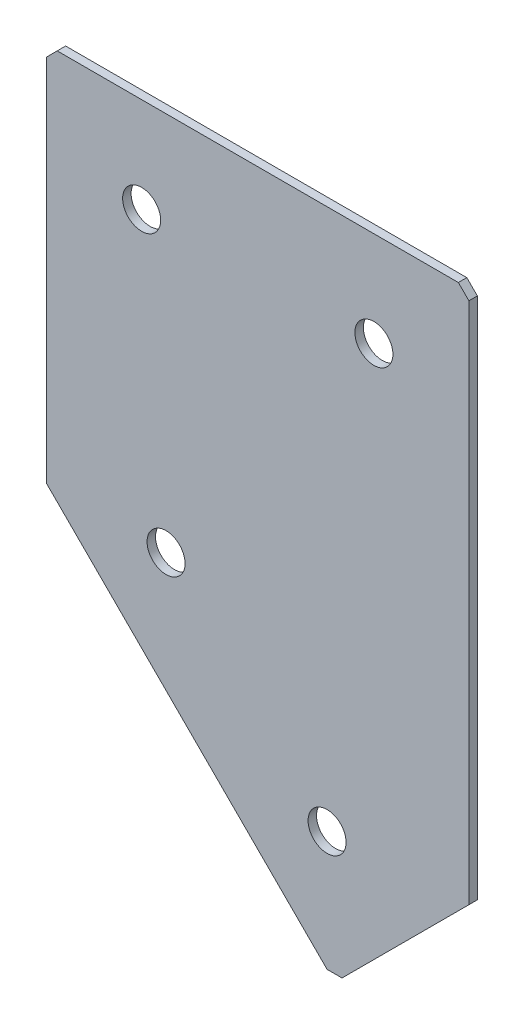
ISO-10303-21;
HEADER;
FILE_DESCRIPTION(('STEP AP214'),'2;1');
FILE_NAME('part.step','',(''),(''),'','','');
FILE_SCHEMA(('AUTOMOTIVE_DESIGN { 1 0 10303 214 1 1 1 1 }'));
ENDSEC;
DATA;
#1=APPLICATION_CONTEXT('core data for automotive mechanical design processes');
#2=APPLICATION_PROTOCOL_DEFINITION('international standard','automotive_design',2000,#1);
#3=PRODUCT_CONTEXT('',#1,'mechanical');
#4=PRODUCT('Part','Part','',(#3));
#5=PRODUCT_RELATED_PRODUCT_CATEGORY('part','',(#4));
#6=PRODUCT_DEFINITION_FORMATION('','',#4);
#7=PRODUCT_DEFINITION_CONTEXT('part definition',#1,'design');
#8=PRODUCT_DEFINITION('design','',#6,#7);
#9=PRODUCT_DEFINITION_SHAPE('','',#8);
#10=(LENGTH_UNIT() NAMED_UNIT(*) SI_UNIT(.MILLI.,.METRE.));
#11=(NAMED_UNIT(*) PLANE_ANGLE_UNIT() SI_UNIT($,.RADIAN.));
#12=(NAMED_UNIT(*) SI_UNIT($,.STERADIAN.) SOLID_ANGLE_UNIT());
#13=UNCERTAINTY_MEASURE_WITH_UNIT(LENGTH_MEASURE(1.E-05),#10,'distance_accuracy_value','');
#14=(GEOMETRIC_REPRESENTATION_CONTEXT(3) GLOBAL_UNCERTAINTY_ASSIGNED_CONTEXT((#13)) GLOBAL_UNIT_ASSIGNED_CONTEXT((#10,
#11,#12)) REPRESENTATION_CONTEXT('',''));
#15=CARTESIAN_POINT('',(0.,0.,0.));
#16=DIRECTION('',(0.,0.,1.));
#17=DIRECTION('',(1.,0.,0.));
#18=AXIS2_PLACEMENT_3D('',#15,#16,#17);
#19=CARTESIAN_POINT('',(0.,0.,-2.));
#20=DIRECTION('',(1.,0.,0.));
#21=DIRECTION('',(0.,0.,-1.));
#22=AXIS2_PLACEMENT_3D('',#19,#20,#21);
#23=PLANE('',#22);
#24=DIRECTION('',(0.,1.,0.));
#25=VECTOR('',#24,1.);
#26=CARTESIAN_POINT('',(0.,0.,0.));
#27=LINE('',#26,#25);
#28=CARTESIAN_POINT('',(0.,-90.,0.));
#29=VERTEX_POINT('',#28);
#30=CARTESIAN_POINT('',(0.,-2.5,0.));
#31=VERTEX_POINT('',#30);
#32=EDGE_CURVE('E137',#29,#31,#27,.T.);
#33=ORIENTED_EDGE('',*,*,#32,.T.);
#34=DIRECTION('',(0.,0.,-1.));
#35=VECTOR('',#34,1.);
#36=CARTESIAN_POINT('',(0.,-2.5,-2.));
#37=LINE('',#36,#35);
#38=CARTESIAN_POINT('',(0.,-2.5,-2.));
#39=VERTEX_POINT('',#38);
#40=EDGE_CURVE('E11',#31,#39,#37,.T.);
#41=ORIENTED_EDGE('',*,*,#40,.T.);
#42=DIRECTION('',(0.,1.,0.));
#43=VECTOR('',#42,1.);
#44=CARTESIAN_POINT('',(0.,0.,-2.));
#45=LINE('',#44,#43);
#46=CARTESIAN_POINT('',(0.,-90.,-2.));
#47=VERTEX_POINT('',#46);
#48=EDGE_CURVE('E153',#47,#39,#45,.T.);
#49=ORIENTED_EDGE('',*,*,#48,.F.);
#50=DIRECTION('',(0.,0.,1.));
#51=VECTOR('',#50,1.);
#52=CARTESIAN_POINT('',(0.,-90.,-2.));
#53=LINE('',#52,#51);
#54=EDGE_CURVE('E125',#47,#29,#53,.T.);
#55=ORIENTED_EDGE('',*,*,#54,.T.);
#56=EDGE_LOOP('',(#33,#41,#49,#55));
#57=FACE_BOUND('',#56,.T.);
#58=ADVANCED_FACE('F39',(#57),#23,.F.);
#59=CARTESIAN_POINT('',(0.,0.,-2.));
#60=DIRECTION('',(0.,-1.,0.));
#61=DIRECTION('',(0.,0.,-1.));
#62=AXIS2_PLACEMENT_3D('',#59,#60,#61);
#63=PLANE('',#62);
#64=DIRECTION('',(1.,0.,0.));
#65=VECTOR('',#64,1.);
#66=CARTESIAN_POINT('',(0.,0.,0.));
#67=LINE('',#66,#65);
#68=CARTESIAN_POINT('',(2.5,0.,0.));
#69=VERTEX_POINT('',#68);
#70=CARTESIAN_POINT('',(97.5,0.,0.));
#71=VERTEX_POINT('',#70);
#72=EDGE_CURVE('E141',#69,#71,#67,.T.);
#73=ORIENTED_EDGE('',*,*,#72,.T.);
#74=DIRECTION('',(0.,0.,-1.));
#75=VECTOR('',#74,1.);
#76=CARTESIAN_POINT('',(97.5,0.,-2.));
#77=LINE('',#76,#75);
#78=CARTESIAN_POINT('',(97.5,0.,-2.));
#79=VERTEX_POINT('',#78);
#80=EDGE_CURVE('E48',#71,#79,#77,.T.);
#81=ORIENTED_EDGE('',*,*,#80,.T.);
#82=DIRECTION('',(1.,0.,0.));
#83=VECTOR('',#82,1.);
#84=CARTESIAN_POINT('',(0.,0.,-2.));
#85=LINE('',#84,#83);
#86=CARTESIAN_POINT('',(2.5,0.,-2.));
#87=VERTEX_POINT('',#86);
#88=EDGE_CURVE('E113',#87,#79,#85,.T.);
#89=ORIENTED_EDGE('',*,*,#88,.F.);
#90=DIRECTION('',(0.,0.,1.));
#91=VECTOR('',#90,1.);
#92=CARTESIAN_POINT('',(2.5,0.,-2.));
#93=LINE('',#92,#91);
#94=EDGE_CURVE('E182',#87,#69,#93,.T.);
#95=ORIENTED_EDGE('',*,*,#94,.T.);
#96=EDGE_LOOP('',(#73,#81,#89,#95));
#97=FACE_BOUND('',#96,.T.);
#98=ADVANCED_FACE('F188',(#97),#63,.F.);
#99=CARTESIAN_POINT('',(100.,0.,-2.));
#100=DIRECTION('',(-1.,0.,0.));
#101=DIRECTION('',(0.,-1.,0.));
#102=AXIS2_PLACEMENT_3D('',#99,#100,#101);
#103=PLANE('',#102);
#104=DIRECTION('',(0.,-1.,0.));
#105=VECTOR('',#104,1.);
#106=CARTESIAN_POINT('',(100.,0.,-2.));
#107=LINE('',#106,#105);
#108=CARTESIAN_POINT('',(100.,-2.5,-2.));
#109=VERTEX_POINT('',#108);
#110=CARTESIAN_POINT('',(100.,-126.360389693211,-2.));
#111=VERTEX_POINT('',#110);
#112=EDGE_CURVE('E103',#109,#111,#107,.T.);
#113=ORIENTED_EDGE('',*,*,#112,.F.);
#114=DIRECTION('',(0.,0.,1.));
#115=VECTOR('',#114,1.);
#116=CARTESIAN_POINT('',(100.,-2.5,-2.));
#117=LINE('',#116,#115);
#118=CARTESIAN_POINT('',(100.,-2.5,0.));
#119=VERTEX_POINT('',#118);
#120=EDGE_CURVE('E179',#109,#119,#117,.T.);
#121=ORIENTED_EDGE('',*,*,#120,.T.);
#122=DIRECTION('',(0.,-1.,0.));
#123=VECTOR('',#122,1.);
#124=CARTESIAN_POINT('',(100.,0.,0.));
#125=LINE('',#124,#123);
#126=CARTESIAN_POINT('',(100.,-126.360389693211,0.));
#127=VERTEX_POINT('',#126);
#128=EDGE_CURVE('E119',#119,#127,#125,.T.);
#129=ORIENTED_EDGE('',*,*,#128,.T.);
#130=DIRECTION('',(0.,0.,1.));
#131=VECTOR('',#130,1.);
#132=CARTESIAN_POINT('',(100.,-126.360389693211,-2.));
#133=LINE('',#132,#131);
#134=EDGE_CURVE('E116',#111,#127,#133,.T.);
#135=ORIENTED_EDGE('',*,*,#134,.F.);
#136=EDGE_LOOP('',(#113,#121,#129,#135));
#137=FACE_BOUND('',#136,.T.);
#138=ADVANCED_FACE('F117',(#137),#103,.F.);
#139=CARTESIAN_POINT('',(68.1801948466053,-158.180194846606,-2.));
#140=DIRECTION('',(-0.707106781186547,0.707106781186548,0.));
#141=DIRECTION('',(-0.707106781186548,-0.707106781186547,0.));
#142=AXIS2_PLACEMENT_3D('',#139,#140,#141);
#143=PLANE('',#142);
#144=DIRECTION('',(-0.707106781186548,-0.707106781186547,0.));
#145=VECTOR('',#144,1.);
#146=CARTESIAN_POINT('',(68.1801948466053,-158.180194846606,0.));
#147=LINE('',#146,#145);
#148=CARTESIAN_POINT('',(69.9479617995717,-156.412427893639,0.));
#149=VERTEX_POINT('',#148);
#150=EDGE_CURVE('E147',#127,#149,#147,.T.);
#151=ORIENTED_EDGE('',*,*,#150,.T.);
#152=DIRECTION('',(0.,0.,-1.));
#153=VECTOR('',#152,1.);
#154=CARTESIAN_POINT('',(69.9479617995717,-156.412427893639,-2.));
#155=LINE('',#154,#153);
#156=CARTESIAN_POINT('',(69.9479617995717,-156.412427893639,-2.));
#157=VERTEX_POINT('',#156);
#158=EDGE_CURVE('E129',#149,#157,#155,.T.);
#159=ORIENTED_EDGE('',*,*,#158,.T.);
#160=DIRECTION('',(-0.707106781186548,-0.707106781186547,0.));
#161=VECTOR('',#160,1.);
#162=CARTESIAN_POINT('',(68.1801948466053,-158.180194846606,-2.));
#163=LINE('',#162,#161);
#164=EDGE_CURVE('E107',#111,#157,#163,.T.);
#165=ORIENTED_EDGE('',*,*,#164,.F.);
#166=ORIENTED_EDGE('',*,*,#134,.T.);
#167=EDGE_LOOP('',(#151,#159,#165,#166));
#168=FACE_BOUND('',#167,.T.);
#169=ADVANCED_FACE('F127',(#168),#143,.F.);
#170=CARTESIAN_POINT('',(0.,-90.,-2.));
#171=DIRECTION('',(0.707106781186549,0.707106781186546,0.));
#172=DIRECTION('',(-0.707106781186546,0.707106781186549,0.));
#173=AXIS2_PLACEMENT_3D('',#170,#171,#172);
#174=PLANE('',#173);
#175=DIRECTION('',(-0.707106781186546,0.707106781186549,0.));
#176=VECTOR('',#175,1.);
#177=CARTESIAN_POINT('',(0.,-90.,-2.));
#178=LINE('',#177,#176);
#179=CARTESIAN_POINT('',(66.4124278936389,-156.412427893639,-2.));
#180=VERTEX_POINT('',#179);
#181=EDGE_CURVE('E131',#180,#47,#178,.T.);
#182=ORIENTED_EDGE('',*,*,#181,.F.);
#183=DIRECTION('',(0.,0.,1.));
#184=VECTOR('',#183,1.);
#185=CARTESIAN_POINT('',(66.4124278936389,-156.412427893639,-2.));
#186=LINE('',#185,#184);
#187=CARTESIAN_POINT('',(66.4124278936389,-156.412427893639,0.));
#188=VERTEX_POINT('',#187);
#189=EDGE_CURVE('E124',#180,#188,#186,.T.);
#190=ORIENTED_EDGE('',*,*,#189,.T.);
#191=DIRECTION('',(-0.707106781186546,0.707106781186549,0.));
#192=VECTOR('',#191,1.);
#193=CARTESIAN_POINT('',(0.,-90.,0.));
#194=LINE('',#193,#192);
#195=EDGE_CURVE('E150',#188,#29,#194,.T.);
#196=ORIENTED_EDGE('',*,*,#195,.T.);
#197=ORIENTED_EDGE('',*,*,#54,.F.);
#198=EDGE_LOOP('',(#182,#190,#196,#197));
#199=FACE_BOUND('',#198,.T.);
#200=ADVANCED_FACE('F218',(#199),#174,.F.);
#201=CARTESIAN_POINT('',(0.,0.,-2.));
#202=DIRECTION('',(0.,0.,1.));
#203=DIRECTION('',(1.,0.,0.));
#204=AXIS2_PLACEMENT_3D('',#201,#202,#203);
#205=PLANE('',#204);
#206=CARTESIAN_POINT('',(77.5,-22.5,-2.));
#207=DIRECTION('',(0.,0.,-1.));
#208=DIRECTION('',(0.,1.,0.));
#209=AXIS2_PLACEMENT_3D('',#206,#207,#208);
#210=CIRCLE('',#209,4.5);
#211=CARTESIAN_POINT('',(77.5,-18.,-2.));
#212=VERTEX_POINT('',#211);
#213=EDGE_CURVE('E250',#212,#212,#210,.T.);
#214=ORIENTED_EDGE('',*,*,#213,.F.);
#215=EDGE_LOOP('',(#214));
#216=FACE_BOUND('',#215,.T.);
#217=CARTESIAN_POINT('',(28.2842712474619,-90.0000000000002,-2.00000000000001));
#218=DIRECTION('',(0.,0.,-1.));
#219=DIRECTION('',(0.,1.,0.));
#220=AXIS2_PLACEMENT_3D('',#217,#218,#219);
#221=CIRCLE('',#220,4.5);
#222=CARTESIAN_POINT('',(28.2842712474619,-85.5000000000002,-2.00000000000001));
#223=VERTEX_POINT('',#222);
#224=EDGE_CURVE('E254',#223,#223,#221,.T.);
#225=ORIENTED_EDGE('',*,*,#224,.F.);
#226=EDGE_LOOP('',(#225));
#227=FACE_BOUND('',#226,.T.);
#228=CARTESIAN_POINT('',(66.412427893639,-128.128156646177,-2.00000000000001));
#229=DIRECTION('',(0.,0.,-1.));
#230=DIRECTION('',(0.,1.,0.));
#231=AXIS2_PLACEMENT_3D('',#228,#229,#230);
#232=CIRCLE('',#231,4.5);
#233=CARTESIAN_POINT('',(66.412427893639,-123.628156646177,-2.00000000000001));
#234=VERTEX_POINT('',#233);
#235=EDGE_CURVE('E264',#234,#234,#232,.T.);
#236=ORIENTED_EDGE('',*,*,#235,.F.);
#237=EDGE_LOOP('',(#236));
#238=FACE_BOUND('',#237,.T.);
#239=CARTESIAN_POINT('',(22.5,-22.5,-2.));
#240=DIRECTION('',(0.,0.,-1.));
#241=DIRECTION('',(0.,1.,0.));
#242=AXIS2_PLACEMENT_3D('',#239,#240,#241);
#243=CIRCLE('',#242,4.5);
#244=CARTESIAN_POINT('',(22.5,-18.,-2.));
#245=VERTEX_POINT('',#244);
#246=EDGE_CURVE('E272',#245,#245,#243,.T.);
#247=ORIENTED_EDGE('',*,*,#246,.F.);
#248=EDGE_LOOP('',(#247));
#249=FACE_BOUND('',#248,.T.);
#250=ORIENTED_EDGE('',*,*,#164,.T.);
#251=DIRECTION('',(1.,0.,0.));
#252=VECTOR('',#251,1.);
#253=CARTESIAN_POINT('',(66.4124278936389,-156.412427893639,-2.));
#254=LINE('',#253,#252);
#255=EDGE_CURVE('E176',#157,#180,#254,.F.);
#256=ORIENTED_EDGE('',*,*,#255,.T.);
#257=ORIENTED_EDGE('',*,*,#181,.T.);
#258=ORIENTED_EDGE('',*,*,#48,.T.);
#259=DIRECTION('',(-0.707106781186548,-0.707106781186548,0.));
#260=VECTOR('',#259,1.);
#261=CARTESIAN_POINT('',(2.5,0.,-2.));
#262=LINE('',#261,#260);
#263=EDGE_CURVE('E171',#39,#87,#262,.F.);
#264=ORIENTED_EDGE('',*,*,#263,.T.);
#265=ORIENTED_EDGE('',*,*,#88,.T.);
#266=DIRECTION('',(-0.707106781186548,0.707106781186548,0.));
#267=VECTOR('',#266,1.);
#268=CARTESIAN_POINT('',(100.,-2.5,-2.));
#269=LINE('',#268,#267);
#270=EDGE_CURVE('E55',#79,#109,#269,.F.);
#271=ORIENTED_EDGE('',*,*,#270,.T.);
#272=ORIENTED_EDGE('',*,*,#112,.T.);
#273=EDGE_LOOP('',(#250,#256,#257,#258,#264,#265,#271,#272));
#274=FACE_BOUND('',#273,.T.);
#275=ADVANCED_FACE('F105',(#216,#227,#238,#249,#274),#205,.F.);
#276=CARTESIAN_POINT('',(0.,0.,0.));
#277=DIRECTION('',(0.,0.,1.));
#278=DIRECTION('',(1.,0.,0.));
#279=AXIS2_PLACEMENT_3D('',#276,#277,#278);
#280=PLANE('',#279);
#281=CARTESIAN_POINT('',(77.5,-22.5,0.));
#282=DIRECTION('',(0.,0.,-1.));
#283=DIRECTION('',(0.,1.,0.));
#284=AXIS2_PLACEMENT_3D('',#281,#282,#283);
#285=CIRCLE('',#284,4.5);
#286=CARTESIAN_POINT('',(77.5,-18.,0.));
#287=VERTEX_POINT('',#286);
#288=EDGE_CURVE('E247',#287,#287,#285,.T.);
#289=ORIENTED_EDGE('',*,*,#288,.T.);
#290=EDGE_LOOP('',(#289));
#291=FACE_BOUND('',#290,.T.);
#292=CARTESIAN_POINT('',(28.2842712474619,-90.0000000000002,0.));
#293=DIRECTION('',(0.,0.,-1.));
#294=DIRECTION('',(0.,1.,0.));
#295=AXIS2_PLACEMENT_3D('',#292,#293,#294);
#296=CIRCLE('',#295,4.5);
#297=CARTESIAN_POINT('',(28.2842712474619,-85.5000000000002,0.));
#298=VERTEX_POINT('',#297);
#299=EDGE_CURVE('E260',#298,#298,#296,.T.);
#300=ORIENTED_EDGE('',*,*,#299,.T.);
#301=EDGE_LOOP('',(#300));
#302=FACE_BOUND('',#301,.T.);
#303=CARTESIAN_POINT('',(66.412427893639,-128.128156646177,0.));
#304=DIRECTION('',(0.,0.,-1.));
#305=DIRECTION('',(0.,1.,0.));
#306=AXIS2_PLACEMENT_3D('',#303,#304,#305);
#307=CIRCLE('',#306,4.5);
#308=CARTESIAN_POINT('',(66.412427893639,-123.628156646177,0.));
#309=VERTEX_POINT('',#308);
#310=EDGE_CURVE('E268',#309,#309,#307,.T.);
#311=ORIENTED_EDGE('',*,*,#310,.T.);
#312=EDGE_LOOP('',(#311));
#313=FACE_BOUND('',#312,.T.);
#314=CARTESIAN_POINT('',(22.5,-22.5,0.));
#315=DIRECTION('',(0.,0.,-1.));
#316=DIRECTION('',(0.,1.,0.));
#317=AXIS2_PLACEMENT_3D('',#314,#315,#316);
#318=CIRCLE('',#317,4.5);
#319=CARTESIAN_POINT('',(22.5,-18.,0.));
#320=VERTEX_POINT('',#319);
#321=EDGE_CURVE('E142',#320,#320,#318,.T.);
#322=ORIENTED_EDGE('',*,*,#321,.T.);
#323=EDGE_LOOP('',(#322));
#324=FACE_BOUND('',#323,.T.);
#325=ORIENTED_EDGE('',*,*,#195,.F.);
#326=DIRECTION('',(-1.,0.,0.));
#327=VECTOR('',#326,1.);
#328=CARTESIAN_POINT('',(0.,-156.412427893639,0.));
#329=LINE('',#328,#327);
#330=EDGE_CURVE('E166',#188,#149,#329,.F.);
#331=ORIENTED_EDGE('',*,*,#330,.T.);
#332=ORIENTED_EDGE('',*,*,#150,.F.);
#333=ORIENTED_EDGE('',*,*,#128,.F.);
#334=DIRECTION('',(0.707106781186548,-0.707106781186548,0.));
#335=VECTOR('',#334,1.);
#336=CARTESIAN_POINT('',(48.75,48.75,0.));
#337=LINE('',#336,#335);
#338=EDGE_CURVE('E163',#119,#71,#337,.F.);
#339=ORIENTED_EDGE('',*,*,#338,.T.);
#340=ORIENTED_EDGE('',*,*,#72,.F.);
#341=DIRECTION('',(0.707106781186548,0.707106781186548,0.));
#342=VECTOR('',#341,1.);
#343=CARTESIAN_POINT('',(1.25,-1.25,0.));
#344=LINE('',#343,#342);
#345=EDGE_CURVE('E160',#69,#31,#344,.F.);
#346=ORIENTED_EDGE('',*,*,#345,.T.);
#347=ORIENTED_EDGE('',*,*,#32,.F.);
#348=EDGE_LOOP('',(#325,#331,#332,#333,#339,#340,#346,#347));
#349=FACE_BOUND('',#348,.T.);
#350=ADVANCED_FACE('F193',(#291,#302,#313,#324,#349),#280,.T.);
#351=CARTESIAN_POINT('',(22.5,-22.5,-2.));
#352=DIRECTION('',(0.,0.,-1.));
#353=DIRECTION('',(0.,1.,0.));
#354=AXIS2_PLACEMENT_3D('',#351,#352,#353);
#355=CYLINDRICAL_SURFACE('',#354,4.5);
#356=ORIENTED_EDGE('',*,*,#321,.F.);
#357=EDGE_LOOP('',(#356));
#358=FACE_BOUND('',#357,.T.);
#359=ORIENTED_EDGE('',*,*,#246,.T.);
#360=EDGE_LOOP('',(#359));
#361=FACE_BOUND('',#360,.T.);
#362=ADVANCED_FACE('F224',(#358,#361),#355,.F.);
#363=CARTESIAN_POINT('',(66.412427893639,-128.128156646177,-2.00000000000001));
#364=DIRECTION('',(0.,0.,-1.));
#365=DIRECTION('',(0.,1.,0.));
#366=AXIS2_PLACEMENT_3D('',#363,#364,#365);
#367=CYLINDRICAL_SURFACE('',#366,4.5);
#368=ORIENTED_EDGE('',*,*,#310,.F.);
#369=EDGE_LOOP('',(#368));
#370=FACE_BOUND('',#369,.T.);
#371=ORIENTED_EDGE('',*,*,#235,.T.);
#372=EDGE_LOOP('',(#371));
#373=FACE_BOUND('',#372,.T.);
#374=ADVANCED_FACE('F231',(#370,#373),#367,.F.);
#375=CARTESIAN_POINT('',(28.2842712474619,-90.0000000000002,-2.00000000000001));
#376=DIRECTION('',(0.,0.,-1.));
#377=DIRECTION('',(0.,1.,0.));
#378=AXIS2_PLACEMENT_3D('',#375,#376,#377);
#379=CYLINDRICAL_SURFACE('',#378,4.5);
#380=ORIENTED_EDGE('',*,*,#299,.F.);
#381=EDGE_LOOP('',(#380));
#382=FACE_BOUND('',#381,.T.);
#383=ORIENTED_EDGE('',*,*,#224,.T.);
#384=EDGE_LOOP('',(#383));
#385=FACE_BOUND('',#384,.T.);
#386=ADVANCED_FACE('F235',(#382,#385),#379,.F.);
#387=CARTESIAN_POINT('',(77.5,-22.5,-2.));
#388=DIRECTION('',(0.,0.,-1.));
#389=DIRECTION('',(0.,1.,0.));
#390=AXIS2_PLACEMENT_3D('',#387,#388,#389);
#391=CYLINDRICAL_SURFACE('',#390,4.5);
#392=ORIENTED_EDGE('',*,*,#288,.F.);
#393=EDGE_LOOP('',(#392));
#394=FACE_BOUND('',#393,.T.);
#395=ORIENTED_EDGE('',*,*,#213,.T.);
#396=EDGE_LOOP('',(#395));
#397=FACE_BOUND('',#396,.T.);
#398=ADVANCED_FACE('F203',(#394,#397),#391,.F.);
#399=CARTESIAN_POINT('',(66.4124278936389,-156.412427893639,-2.));
#400=DIRECTION('',(0.,1.,0.));
#401=DIRECTION('',(0.,0.,1.));
#402=AXIS2_PLACEMENT_3D('',#399,#400,#401);
#403=PLANE('',#402);
#404=ORIENTED_EDGE('',*,*,#255,.F.);
#405=ORIENTED_EDGE('',*,*,#158,.F.);
#406=ORIENTED_EDGE('',*,*,#330,.F.);
#407=ORIENTED_EDGE('',*,*,#189,.F.);
#408=EDGE_LOOP('',(#404,#405,#406,#407));
#409=FACE_BOUND('',#408,.T.);
#410=ADVANCED_FACE('F198',(#409),#403,.F.);
#411=CARTESIAN_POINT('',(100.,-2.5,-2.));
#412=DIRECTION('',(-0.707106781186547,-0.707106781186547,0.));
#413=DIRECTION('',(0.,0.,1.));
#414=AXIS2_PLACEMENT_3D('',#411,#412,#413);
#415=PLANE('',#414);
#416=ORIENTED_EDGE('',*,*,#270,.F.);
#417=ORIENTED_EDGE('',*,*,#80,.F.);
#418=ORIENTED_EDGE('',*,*,#338,.F.);
#419=ORIENTED_EDGE('',*,*,#120,.F.);
#420=EDGE_LOOP('',(#416,#417,#418,#419));
#421=FACE_BOUND('',#420,.T.);
#422=ADVANCED_FACE('F196',(#421),#415,.F.);
#423=CARTESIAN_POINT('',(2.5,0.,-2.));
#424=DIRECTION('',(0.707106781186547,-0.707106781186547,0.));
#425=DIRECTION('',(0.,0.,1.));
#426=AXIS2_PLACEMENT_3D('',#423,#424,#425);
#427=PLANE('',#426);
#428=ORIENTED_EDGE('',*,*,#263,.F.);
#429=ORIENTED_EDGE('',*,*,#40,.F.);
#430=ORIENTED_EDGE('',*,*,#345,.F.);
#431=ORIENTED_EDGE('',*,*,#94,.F.);
#432=EDGE_LOOP('',(#428,#429,#430,#431));
#433=FACE_BOUND('',#432,.T.);
#434=ADVANCED_FACE('F41',(#433),#427,.F.);
#435=CLOSED_SHELL('',(#58,#98,#138,#169,#200,#275,#350,#362,#374,#386,#398,#410,#422,#434));
#436=MANIFOLD_SOLID_BREP('B2',#435);
#437=ADVANCED_BREP_SHAPE_REPRESENTATION('',(#18,#436),#14);
#438=SHAPE_DEFINITION_REPRESENTATION(#9,#437);
ENDSEC;
END-ISO-10303-21;
